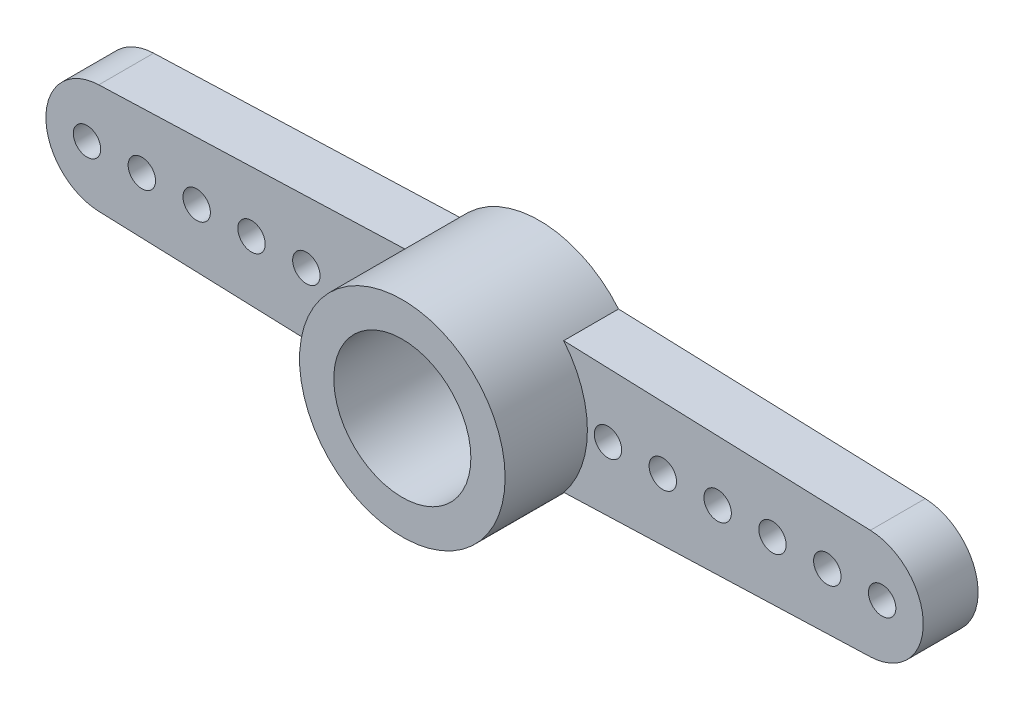
ISO-10303-21;
HEADER;
FILE_DESCRIPTION(('STEP AP214'),'2;1');
FILE_NAME('part.step','',(''),(''),'','','');
FILE_SCHEMA(('AUTOMOTIVE_DESIGN { 1 0 10303 214 1 1 1 1 }'));
ENDSEC;
DATA;
#1=APPLICATION_CONTEXT('core data for automotive mechanical design processes');
#2=APPLICATION_PROTOCOL_DEFINITION('international standard','automotive_design',2000,#1);
#3=PRODUCT_CONTEXT('',#1,'mechanical');
#4=PRODUCT('Part','Part','',(#3));
#5=PRODUCT_RELATED_PRODUCT_CATEGORY('part','',(#4));
#6=PRODUCT_DEFINITION_FORMATION('','',#4);
#7=PRODUCT_DEFINITION_CONTEXT('part definition',#1,'design');
#8=PRODUCT_DEFINITION('design','',#6,#7);
#9=PRODUCT_DEFINITION_SHAPE('','',#8);
#10=(LENGTH_UNIT() NAMED_UNIT(*) SI_UNIT(.MILLI.,.METRE.));
#11=(NAMED_UNIT(*) PLANE_ANGLE_UNIT() SI_UNIT($,.RADIAN.));
#12=(NAMED_UNIT(*) SI_UNIT($,.STERADIAN.) SOLID_ANGLE_UNIT());
#13=UNCERTAINTY_MEASURE_WITH_UNIT(LENGTH_MEASURE(1.E-05),#10,'distance_accuracy_value','');
#14=(GEOMETRIC_REPRESENTATION_CONTEXT(3) GLOBAL_UNCERTAINTY_ASSIGNED_CONTEXT((#13)) GLOBAL_UNIT_ASSIGNED_CONTEXT((#10,
#11,#12)) REPRESENTATION_CONTEXT('',''));
#15=CARTESIAN_POINT('',(0.,0.,0.));
#16=DIRECTION('',(0.,0.,1.));
#17=DIRECTION('',(1.,0.,0.));
#18=AXIS2_PLACEMENT_3D('',#15,#16,#17);
#19=CARTESIAN_POINT('',(0.,0.,0.));
#20=DIRECTION('',(0.,0.,1.));
#21=DIRECTION('',(1.,0.,0.));
#22=AXIS2_PLACEMENT_3D('',#19,#20,#21);
#23=CYLINDRICAL_SURFACE('',#22,2.5);
#24=CARTESIAN_POINT('',(0.,0.,5.));
#25=DIRECTION('',(0.,0.,1.));
#26=DIRECTION('',(1.,0.,0.));
#27=AXIS2_PLACEMENT_3D('',#24,#25,#26);
#28=CIRCLE('',#27,2.5);
#29=CARTESIAN_POINT('',(2.5,0.,5.));
#30=VERTEX_POINT('',#29);
#31=EDGE_CURVE('E543',#30,#30,#28,.T.);
#32=ORIENTED_EDGE('',*,*,#31,.T.);
#33=EDGE_LOOP('',(#32));
#34=FACE_BOUND('',#33,.T.);
#35=CARTESIAN_POINT('',(0.,0.,1.));
#36=DIRECTION('',(0.,0.,-1.));
#37=DIRECTION('',(-1.,0.,0.));
#38=AXIS2_PLACEMENT_3D('',#35,#36,#37);
#39=CIRCLE('',#38,2.5);
#40=CARTESIAN_POINT('',(-2.5,0.,1.));
#41=VERTEX_POINT('',#40);
#42=EDGE_CURVE('E469',#41,#41,#39,.T.);
#43=ORIENTED_EDGE('',*,*,#42,.T.);
#44=EDGE_LOOP('',(#43));
#45=FACE_BOUND('',#44,.T.);
#46=ADVANCED_FACE('F45',(#34,#45),#23,.F.);
#47=CARTESIAN_POINT('',(0.,0.,2.));
#48=DIRECTION('',(0.,0.,1.));
#49=DIRECTION('',(1.,0.,0.));
#50=AXIS2_PLACEMENT_3D('',#47,#48,#49);
#51=PLANE('',#50);
#52=CARTESIAN_POINT('',(-12.5,0.,2.));
#53=DIRECTION('',(0.,0.,-1.));
#54=DIRECTION('',(-1.,0.,0.));
#55=AXIS2_PLACEMENT_3D('',#52,#53,#54);
#56=CIRCLE('',#55,0.500000000000001);
#57=CARTESIAN_POINT('',(-13.,0.,2.));
#58=VERTEX_POINT('',#57);
#59=EDGE_CURVE('E483',#58,#58,#56,.F.);
#60=ORIENTED_EDGE('',*,*,#59,.F.);
#61=EDGE_LOOP('',(#60));
#62=FACE_BOUND('',#61,.T.);
#63=CARTESIAN_POINT('',(-8.5,0.,2.));
#64=DIRECTION('',(0.,0.,-1.));
#65=DIRECTION('',(-1.,0.,0.));
#66=AXIS2_PLACEMENT_3D('',#63,#64,#65);
#67=CIRCLE('',#66,0.500000000000001);
#68=CARTESIAN_POINT('',(-9.,0.,2.));
#69=VERTEX_POINT('',#68);
#70=EDGE_CURVE('E495',#69,#69,#67,.F.);
#71=ORIENTED_EDGE('',*,*,#70,.F.);
#72=EDGE_LOOP('',(#71));
#73=FACE_BOUND('',#72,.T.);
#74=CARTESIAN_POINT('',(-4.5,0.,2.));
#75=DIRECTION('',(0.,0.,-1.));
#76=DIRECTION('',(-1.,0.,0.));
#77=AXIS2_PLACEMENT_3D('',#74,#75,#76);
#78=CIRCLE('',#77,0.500000000000001);
#79=CARTESIAN_POINT('',(-5.,0.,2.));
#80=VERTEX_POINT('',#79);
#81=EDGE_CURVE('E507',#80,#80,#78,.F.);
#82=ORIENTED_EDGE('',*,*,#81,.F.);
#83=EDGE_LOOP('',(#82));
#84=FACE_BOUND('',#83,.T.);
#85=CARTESIAN_POINT('',(0.,0.,2.));
#86=DIRECTION('',(0.,0.,1.));
#87=DIRECTION('',(1.,0.,0.));
#88=AXIS2_PLACEMENT_3D('',#85,#86,#87);
#89=CIRCLE('',#88,3.75);
#90=CARTESIAN_POINT('',(-2.88547071027724,2.39511143376089,2.));
#91=VERTEX_POINT('',#90);
#92=CARTESIAN_POINT('',(-2.88547071027724,-2.39511143376089,2.));
#93=VERTEX_POINT('',#92);
#94=EDGE_CURVE('E12',#91,#93,#89,.T.);
#95=ORIENTED_EDGE('',*,*,#94,.F.);
#96=DIRECTION('',(0.999372730394994,0.0354139201848026,0.));
#97=VECTOR('',#96,1.);
#98=CARTESIAN_POINT('',(-0.0883858807695831,2.49422934631706,2.));
#99=LINE('',#98,#97);
#100=CARTESIAN_POINT('',(-14.0708278403696,1.99874546078999,2.));
#101=VERTEX_POINT('',#100);
#102=EDGE_CURVE('E190',#101,#91,#99,.T.);
#103=ORIENTED_EDGE('',*,*,#102,.F.);
#104=CARTESIAN_POINT('',(-14.,0.,2.));
#105=DIRECTION('',(0.,0.,1.));
#106=DIRECTION('',(1.,0.,0.));
#107=AXIS2_PLACEMENT_3D('',#104,#105,#106);
#108=CIRCLE('',#107,2.);
#109=CARTESIAN_POINT('',(-14.0708278403696,-1.99874546078999,2.));
#110=VERTEX_POINT('',#109);
#111=EDGE_CURVE('E183',#110,#101,#108,.F.);
#112=ORIENTED_EDGE('',*,*,#111,.F.);
#113=DIRECTION('',(0.999372730394994,-0.0354139201848024,0.));
#114=VECTOR('',#113,1.);
#115=CARTESIAN_POINT('',(-0.0883858807695825,-2.49422934631706,2.));
#116=LINE('',#115,#114);
#117=EDGE_CURVE('E187',#110,#93,#116,.T.);
#118=ORIENTED_EDGE('',*,*,#117,.T.);
#119=EDGE_LOOP('',(#95,#103,#112,#118));
#120=FACE_BOUND('',#119,.T.);
#121=CARTESIAN_POINT('',(-6.5,0.,2.));
#122=DIRECTION('',(0.,0.,-1.));
#123=DIRECTION('',(-1.,0.,0.));
#124=AXIS2_PLACEMENT_3D('',#121,#122,#123);
#125=CIRCLE('',#124,0.500000000000001);
#126=CARTESIAN_POINT('',(-7.,0.,2.));
#127=VERTEX_POINT('',#126);
#128=EDGE_CURVE('E501',#127,#127,#125,.F.);
#129=ORIENTED_EDGE('',*,*,#128,.F.);
#130=EDGE_LOOP('',(#129));
#131=FACE_BOUND('',#130,.T.);
#132=CARTESIAN_POINT('',(-10.5,0.,2.));
#133=DIRECTION('',(0.,0.,-1.));
#134=DIRECTION('',(-1.,0.,0.));
#135=AXIS2_PLACEMENT_3D('',#132,#133,#134);
#136=CIRCLE('',#135,0.500000000000001);
#137=CARTESIAN_POINT('',(-11.,0.,2.));
#138=VERTEX_POINT('',#137);
#139=EDGE_CURVE('E489',#138,#138,#136,.F.);
#140=ORIENTED_EDGE('',*,*,#139,.F.);
#141=EDGE_LOOP('',(#140));
#142=FACE_BOUND('',#141,.T.);
#143=CARTESIAN_POINT('',(-14.5,0.,2.));
#144=DIRECTION('',(0.,0.,-1.));
#145=DIRECTION('',(-1.,0.,0.));
#146=AXIS2_PLACEMENT_3D('',#143,#144,#145);
#147=CIRCLE('',#146,0.500000000000001);
#148=CARTESIAN_POINT('',(-15.,0.,2.));
#149=VERTEX_POINT('',#148);
#150=EDGE_CURVE('E477',#149,#149,#147,.F.);
#151=ORIENTED_EDGE('',*,*,#150,.F.);
#152=EDGE_LOOP('',(#151));
#153=FACE_BOUND('',#152,.T.);
#154=ADVANCED_FACE('F191',(#62,#73,#84,#120,#131,#142,#153),#51,.T.);
#155=CARTESIAN_POINT('',(0.,0.,0.));
#156=DIRECTION('',(0.,0.,1.));
#157=DIRECTION('',(1.,0.,0.));
#158=AXIS2_PLACEMENT_3D('',#155,#156,#157);
#159=PLANE('',#158);
#160=CARTESIAN_POINT('',(0.,0.,0.));
#161=DIRECTION('',(0.,0.,-1.));
#162=DIRECTION('',(-1.,0.,0.));
#163=AXIS2_PLACEMENT_3D('',#160,#161,#162);
#164=CIRCLE('',#163,2.5);
#165=CARTESIAN_POINT('',(-2.5,0.,0.));
#166=VERTEX_POINT('',#165);
#167=EDGE_CURVE('E461',#166,#166,#164,.T.);
#168=ORIENTED_EDGE('',*,*,#167,.F.);
#169=EDGE_LOOP('',(#168));
#170=FACE_BOUND('',#169,.T.);
#171=CARTESIAN_POINT('',(12.5,0.,0.));
#172=DIRECTION('',(0.,0.,-1.));
#173=DIRECTION('',(-1.,0.,0.));
#174=AXIS2_PLACEMENT_3D('',#171,#172,#173);
#175=CIRCLE('',#174,0.500000000000001);
#176=CARTESIAN_POINT('',(12.,0.,0.));
#177=VERTEX_POINT('',#176);
#178=EDGE_CURVE('E474',#177,#177,#175,.T.);
#179=ORIENTED_EDGE('',*,*,#178,.F.);
#180=EDGE_LOOP('',(#179));
#181=FACE_BOUND('',#180,.T.);
#182=CARTESIAN_POINT('',(-12.5,0.,0.));
#183=DIRECTION('',(0.,0.,-1.));
#184=DIRECTION('',(-1.,0.,0.));
#185=AXIS2_PLACEMENT_3D('',#182,#183,#184);
#186=CIRCLE('',#185,0.500000000000001);
#187=CARTESIAN_POINT('',(-13.,0.,0.));
#188=VERTEX_POINT('',#187);
#189=EDGE_CURVE('E486',#188,#188,#186,.F.);
#190=ORIENTED_EDGE('',*,*,#189,.T.);
#191=EDGE_LOOP('',(#190));
#192=FACE_BOUND('',#191,.T.);
#193=CARTESIAN_POINT('',(-8.5,0.,0.));
#194=DIRECTION('',(0.,0.,-1.));
#195=DIRECTION('',(-1.,0.,0.));
#196=AXIS2_PLACEMENT_3D('',#193,#194,#195);
#197=CIRCLE('',#196,0.500000000000001);
#198=CARTESIAN_POINT('',(-9.,0.,0.));
#199=VERTEX_POINT('',#198);
#200=EDGE_CURVE('E498',#199,#199,#197,.F.);
#201=ORIENTED_EDGE('',*,*,#200,.T.);
#202=EDGE_LOOP('',(#201));
#203=FACE_BOUND('',#202,.T.);
#204=CARTESIAN_POINT('',(-4.5,0.,0.));
#205=DIRECTION('',(0.,0.,-1.));
#206=DIRECTION('',(-1.,0.,0.));
#207=AXIS2_PLACEMENT_3D('',#204,#205,#206);
#208=CIRCLE('',#207,0.500000000000001);
#209=CARTESIAN_POINT('',(-5.,0.,0.));
#210=VERTEX_POINT('',#209);
#211=EDGE_CURVE('E510',#210,#210,#208,.F.);
#212=ORIENTED_EDGE('',*,*,#211,.T.);
#213=EDGE_LOOP('',(#212));
#214=FACE_BOUND('',#213,.T.);
#215=CARTESIAN_POINT('',(4.5,0.,0.));
#216=DIRECTION('',(0.,0.,-1.));
#217=DIRECTION('',(-1.,0.,0.));
#218=AXIS2_PLACEMENT_3D('',#215,#216,#217);
#219=CIRCLE('',#218,0.500000000000001);
#220=CARTESIAN_POINT('',(4.,0.,0.));
#221=VERTEX_POINT('',#220);
#222=EDGE_CURVE('E516',#221,#221,#219,.T.);
#223=ORIENTED_EDGE('',*,*,#222,.F.);
#224=EDGE_LOOP('',(#223));
#225=FACE_BOUND('',#224,.T.);
#226=CARTESIAN_POINT('',(6.5,0.,0.));
#227=DIRECTION('',(0.,0.,-1.));
#228=DIRECTION('',(-1.,0.,0.));
#229=AXIS2_PLACEMENT_3D('',#226,#227,#228);
#230=CIRCLE('',#229,0.500000000000001);
#231=CARTESIAN_POINT('',(6.,0.,0.));
#232=VERTEX_POINT('',#231);
#233=EDGE_CURVE('E522',#232,#232,#230,.T.);
#234=ORIENTED_EDGE('',*,*,#233,.F.);
#235=EDGE_LOOP('',(#234));
#236=FACE_BOUND('',#235,.T.);
#237=CARTESIAN_POINT('',(8.5,0.,0.));
#238=DIRECTION('',(0.,0.,-1.));
#239=DIRECTION('',(-1.,0.,0.));
#240=AXIS2_PLACEMENT_3D('',#237,#238,#239);
#241=CIRCLE('',#240,0.500000000000001);
#242=CARTESIAN_POINT('',(8.,0.,0.));
#243=VERTEX_POINT('',#242);
#244=EDGE_CURVE('E528',#243,#243,#241,.T.);
#245=ORIENTED_EDGE('',*,*,#244,.F.);
#246=EDGE_LOOP('',(#245));
#247=FACE_BOUND('',#246,.T.);
#248=CARTESIAN_POINT('',(10.5,0.,0.));
#249=DIRECTION('',(0.,0.,-1.));
#250=DIRECTION('',(-1.,0.,0.));
#251=AXIS2_PLACEMENT_3D('',#248,#249,#250);
#252=CIRCLE('',#251,0.500000000000001);
#253=CARTESIAN_POINT('',(10.,0.,0.));
#254=VERTEX_POINT('',#253);
#255=EDGE_CURVE('E534',#254,#254,#252,.T.);
#256=ORIENTED_EDGE('',*,*,#255,.F.);
#257=EDGE_LOOP('',(#256));
#258=FACE_BOUND('',#257,.T.);
#259=CARTESIAN_POINT('',(14.5,0.,0.));
#260=DIRECTION('',(0.,0.,-1.));
#261=DIRECTION('',(-1.,0.,0.));
#262=AXIS2_PLACEMENT_3D('',#259,#260,#261);
#263=CIRCLE('',#262,0.500000000000001);
#264=CARTESIAN_POINT('',(14.,0.,0.));
#265=VERTEX_POINT('',#264);
#266=EDGE_CURVE('E537',#265,#265,#263,.T.);
#267=ORIENTED_EDGE('',*,*,#266,.F.);
#268=EDGE_LOOP('',(#267));
#269=FACE_BOUND('',#268,.T.);
#270=DIRECTION('',(-0.999372730394994,-0.0354139201848029,0.));
#271=VECTOR('',#270,1.);
#272=CARTESIAN_POINT('',(0.0883858807695838,-2.49422934631706,0.));
#273=LINE('',#272,#271);
#274=CARTESIAN_POINT('',(14.0708278403696,-1.99874546078998,0.));
#275=VERTEX_POINT('',#274);
#276=CARTESIAN_POINT('',(2.88547071027724,-2.39511143376089,0.));
#277=VERTEX_POINT('',#276);
#278=EDGE_CURVE('E119',#275,#277,#273,.T.);
#279=ORIENTED_EDGE('',*,*,#278,.T.);
#280=CARTESIAN_POINT('',(0.,0.,0.));
#281=DIRECTION('',(0.,0.,-1.));
#282=DIRECTION('',(-1.,0.,0.));
#283=AXIS2_PLACEMENT_3D('',#280,#281,#282);
#284=CIRCLE('',#283,3.75);
#285=CARTESIAN_POINT('',(-2.88547071027724,-2.39511143376089,0.));
#286=VERTEX_POINT('',#285);
#287=EDGE_CURVE('E96',#277,#286,#284,.T.);
#288=ORIENTED_EDGE('',*,*,#287,.T.);
#289=DIRECTION('',(0.999372730394994,-0.0354139201848024,0.));
#290=VECTOR('',#289,1.);
#291=CARTESIAN_POINT('',(-0.0883858807695825,-2.49422934631706,0.));
#292=LINE('',#291,#290);
#293=CARTESIAN_POINT('',(-14.0708278403696,-1.99874546078999,0.));
#294=VERTEX_POINT('',#293);
#295=EDGE_CURVE('E153',#294,#286,#292,.T.);
#296=ORIENTED_EDGE('',*,*,#295,.F.);
#297=CARTESIAN_POINT('',(-14.,0.,0.));
#298=DIRECTION('',(0.,0.,1.));
#299=DIRECTION('',(1.,0.,0.));
#300=AXIS2_PLACEMENT_3D('',#297,#298,#299);
#301=CIRCLE('',#300,2.);
#302=CARTESIAN_POINT('',(-14.0708278403696,1.99874546078999,0.));
#303=VERTEX_POINT('',#302);
#304=EDGE_CURVE('E185',#294,#303,#301,.F.);
#305=ORIENTED_EDGE('',*,*,#304,.T.);
#306=DIRECTION('',(0.999372730394994,0.0354139201848026,0.));
#307=VECTOR('',#306,1.);
#308=CARTESIAN_POINT('',(-0.0883858807695831,2.49422934631706,0.));
#309=LINE('',#308,#307);
#310=CARTESIAN_POINT('',(-2.88547071027724,2.39511143376089,0.));
#311=VERTEX_POINT('',#310);
#312=EDGE_CURVE('E62',#303,#311,#309,.T.);
#313=ORIENTED_EDGE('',*,*,#312,.T.);
#314=CARTESIAN_POINT('',(2.88547071027724,2.39511143376089,0.));
#315=VERTEX_POINT('',#314);
#316=EDGE_CURVE('E86',#311,#315,#284,.T.);
#317=ORIENTED_EDGE('',*,*,#316,.T.);
#318=DIRECTION('',(-0.999372730394994,0.0354139201848023,0.));
#319=VECTOR('',#318,1.);
#320=CARTESIAN_POINT('',(0.0883858807695825,2.49422934631706,0.));
#321=LINE('',#320,#319);
#322=CARTESIAN_POINT('',(14.0708278403696,1.99874546078999,0.));
#323=VERTEX_POINT('',#322);
#324=EDGE_CURVE('E93',#323,#315,#321,.T.);
#325=ORIENTED_EDGE('',*,*,#324,.F.);
#326=CARTESIAN_POINT('',(14.,0.,0.));
#327=DIRECTION('',(0.,0.,1.));
#328=DIRECTION('',(1.,0.,0.));
#329=AXIS2_PLACEMENT_3D('',#326,#327,#328);
#330=CIRCLE('',#329,2.);
#331=EDGE_CURVE('E115',#275,#323,#330,.T.);
#332=ORIENTED_EDGE('',*,*,#331,.F.);
#333=EDGE_LOOP('',(#279,#288,#296,#305,#313,#317,#325,#332));
#334=FACE_BOUND('',#333,.T.);
#335=CARTESIAN_POINT('',(-6.5,0.,0.));
#336=DIRECTION('',(0.,0.,-1.));
#337=DIRECTION('',(-1.,0.,0.));
#338=AXIS2_PLACEMENT_3D('',#335,#336,#337);
#339=CIRCLE('',#338,0.500000000000001);
#340=CARTESIAN_POINT('',(-7.,0.,0.));
#341=VERTEX_POINT('',#340);
#342=EDGE_CURVE('E504',#341,#341,#339,.F.);
#343=ORIENTED_EDGE('',*,*,#342,.T.);
#344=EDGE_LOOP('',(#343));
#345=FACE_BOUND('',#344,.T.);
#346=CARTESIAN_POINT('',(-10.5,0.,0.));
#347=DIRECTION('',(0.,0.,-1.));
#348=DIRECTION('',(-1.,0.,0.));
#349=AXIS2_PLACEMENT_3D('',#346,#347,#348);
#350=CIRCLE('',#349,0.500000000000001);
#351=CARTESIAN_POINT('',(-11.,0.,0.));
#352=VERTEX_POINT('',#351);
#353=EDGE_CURVE('E492',#352,#352,#350,.F.);
#354=ORIENTED_EDGE('',*,*,#353,.T.);
#355=EDGE_LOOP('',(#354));
#356=FACE_BOUND('',#355,.T.);
#357=CARTESIAN_POINT('',(-14.5,0.,0.));
#358=DIRECTION('',(0.,0.,-1.));
#359=DIRECTION('',(-1.,0.,0.));
#360=AXIS2_PLACEMENT_3D('',#357,#358,#359);
#361=CIRCLE('',#360,0.500000000000001);
#362=CARTESIAN_POINT('',(-15.,0.,0.));
#363=VERTEX_POINT('',#362);
#364=EDGE_CURVE('E480',#363,#363,#361,.F.);
#365=ORIENTED_EDGE('',*,*,#364,.T.);
#366=EDGE_LOOP('',(#365));
#367=FACE_BOUND('',#366,.T.);
#368=ADVANCED_FACE('F89',(#170,#181,#192,#203,#214,#225,#236,#247,#258,#269,#334,#345,#356,
#367),#159,.F.);
#369=CARTESIAN_POINT('',(0.0883858807695838,-2.49422934631706,2.));
#370=DIRECTION('',(0.0354139201848029,-0.999372730394994,0.));
#371=DIRECTION('',(0.999372730394994,0.0354139201848029,0.));
#372=AXIS2_PLACEMENT_3D('',#369,#370,#371);
#373=PLANE('',#372);
#374=ORIENTED_EDGE('',*,*,#278,.F.);
#375=DIRECTION('',(0.,0.,-1.));
#376=VECTOR('',#375,1.);
#377=CARTESIAN_POINT('',(14.0708278403696,-1.99874546078998,2.));
#378=LINE('',#377,#376);
#379=CARTESIAN_POINT('',(14.0708278403696,-1.99874546078998,2.));
#380=VERTEX_POINT('',#379);
#381=EDGE_CURVE('E124',#380,#275,#378,.T.);
#382=ORIENTED_EDGE('',*,*,#381,.F.);
#383=DIRECTION('',(-0.999372730394994,-0.0354139201848029,0.));
#384=VECTOR('',#383,1.);
#385=CARTESIAN_POINT('',(0.0883858807695838,-2.49422934631706,2.));
#386=LINE('',#385,#384);
#387=CARTESIAN_POINT('',(2.88547071027724,-2.39511143376089,2.));
#388=VERTEX_POINT('',#387);
#389=EDGE_CURVE('E114',#380,#388,#386,.T.);
#390=ORIENTED_EDGE('',*,*,#389,.T.);
#391=DIRECTION('',(0.,0.,-1.));
#392=VECTOR('',#391,1.);
#393=CARTESIAN_POINT('',(2.88547071027724,-2.39511143376089,2.));
#394=LINE('',#393,#392);
#395=EDGE_CURVE('E110',#388,#277,#394,.T.);
#396=ORIENTED_EDGE('',*,*,#395,.T.);
#397=EDGE_LOOP('',(#374,#382,#390,#396));
#398=FACE_BOUND('',#397,.T.);
#399=ADVANCED_FACE('F47',(#398),#373,.T.);
#400=CARTESIAN_POINT('',(14.,0.,2.));
#401=DIRECTION('',(0.,0.,-1.));
#402=DIRECTION('',(-1.,0.,0.));
#403=AXIS2_PLACEMENT_3D('',#400,#401,#402);
#404=CYLINDRICAL_SURFACE('',#403,2.);
#405=ORIENTED_EDGE('',*,*,#331,.T.);
#406=DIRECTION('',(0.,0.,-1.));
#407=VECTOR('',#406,1.);
#408=CARTESIAN_POINT('',(14.0708278403696,1.99874546078999,2.));
#409=LINE('',#408,#407);
#410=CARTESIAN_POINT('',(14.0708278403696,1.99874546078999,2.));
#411=VERTEX_POINT('',#410);
#412=EDGE_CURVE('E109',#411,#323,#409,.T.);
#413=ORIENTED_EDGE('',*,*,#412,.F.);
#414=CARTESIAN_POINT('',(14.,0.,2.));
#415=DIRECTION('',(0.,0.,1.));
#416=DIRECTION('',(1.,0.,0.));
#417=AXIS2_PLACEMENT_3D('',#414,#415,#416);
#418=CIRCLE('',#417,2.);
#419=EDGE_CURVE('E71',#380,#411,#418,.T.);
#420=ORIENTED_EDGE('',*,*,#419,.F.);
#421=ORIENTED_EDGE('',*,*,#381,.T.);
#422=EDGE_LOOP('',(#405,#413,#420,#421));
#423=FACE_BOUND('',#422,.T.);
#424=ADVANCED_FACE('F246',(#423),#404,.T.);
#425=CARTESIAN_POINT('',(0.0883858807695825,2.49422934631706,2.));
#426=DIRECTION('',(-0.0354139201848023,-0.999372730394994,0.));
#427=DIRECTION('',(0.999372730394994,-0.0354139201848023,0.));
#428=AXIS2_PLACEMENT_3D('',#425,#426,#427);
#429=PLANE('',#428);
#430=ORIENTED_EDGE('',*,*,#324,.T.);
#431=DIRECTION('',(0.,0.,-1.));
#432=VECTOR('',#431,1.);
#433=CARTESIAN_POINT('',(2.88547071027724,2.39511143376089,2.));
#434=LINE('',#433,#432);
#435=CARTESIAN_POINT('',(2.88547071027724,2.39511143376089,2.));
#436=VERTEX_POINT('',#435);
#437=EDGE_CURVE('E101',#436,#315,#434,.T.);
#438=ORIENTED_EDGE('',*,*,#437,.F.);
#439=DIRECTION('',(-0.999372730394994,0.0354139201848023,0.));
#440=VECTOR('',#439,1.);
#441=CARTESIAN_POINT('',(0.0883858807695825,2.49422934631706,2.));
#442=LINE('',#441,#440);
#443=EDGE_CURVE('E138',#411,#436,#442,.T.);
#444=ORIENTED_EDGE('',*,*,#443,.F.);
#445=ORIENTED_EDGE('',*,*,#412,.T.);
#446=EDGE_LOOP('',(#430,#438,#444,#445));
#447=FACE_BOUND('',#446,.T.);
#448=ADVANCED_FACE('F113',(#447),#429,.F.);
#449=CARTESIAN_POINT('',(12.5,0.,2.));
#450=DIRECTION('',(0.,0.,-1.));
#451=DIRECTION('',(-1.,0.,0.));
#452=AXIS2_PLACEMENT_3D('',#449,#450,#451);
#453=CIRCLE('',#452,0.500000000000001);
#454=CARTESIAN_POINT('',(12.,0.,2.));
#455=VERTEX_POINT('',#454);
#456=EDGE_CURVE('E473',#455,#455,#453,.T.);
#457=ORIENTED_EDGE('',*,*,#456,.T.);
#458=EDGE_LOOP('',(#457));
#459=FACE_BOUND('',#458,.T.);
#460=CARTESIAN_POINT('',(4.5,0.,2.));
#461=DIRECTION('',(0.,0.,-1.));
#462=DIRECTION('',(-1.,0.,0.));
#463=AXIS2_PLACEMENT_3D('',#460,#461,#462);
#464=CIRCLE('',#463,0.500000000000001);
#465=CARTESIAN_POINT('',(4.,0.,2.));
#466=VERTEX_POINT('',#465);
#467=EDGE_CURVE('E513',#466,#466,#464,.T.);
#468=ORIENTED_EDGE('',*,*,#467,.T.);
#469=EDGE_LOOP('',(#468));
#470=FACE_BOUND('',#469,.T.);
#471=CARTESIAN_POINT('',(6.5,0.,2.));
#472=DIRECTION('',(0.,0.,-1.));
#473=DIRECTION('',(-1.,0.,0.));
#474=AXIS2_PLACEMENT_3D('',#471,#472,#473);
#475=CIRCLE('',#474,0.500000000000001);
#476=CARTESIAN_POINT('',(6.,0.,2.));
#477=VERTEX_POINT('',#476);
#478=EDGE_CURVE('E519',#477,#477,#475,.T.);
#479=ORIENTED_EDGE('',*,*,#478,.T.);
#480=EDGE_LOOP('',(#479));
#481=FACE_BOUND('',#480,.T.);
#482=CARTESIAN_POINT('',(8.5,0.,2.));
#483=DIRECTION('',(0.,0.,-1.));
#484=DIRECTION('',(-1.,0.,0.));
#485=AXIS2_PLACEMENT_3D('',#482,#483,#484);
#486=CIRCLE('',#485,0.500000000000001);
#487=CARTESIAN_POINT('',(8.,0.,2.));
#488=VERTEX_POINT('',#487);
#489=EDGE_CURVE('E525',#488,#488,#486,.T.);
#490=ORIENTED_EDGE('',*,*,#489,.T.);
#491=EDGE_LOOP('',(#490));
#492=FACE_BOUND('',#491,.T.);
#493=CARTESIAN_POINT('',(10.5,0.,2.));
#494=DIRECTION('',(0.,0.,-1.));
#495=DIRECTION('',(-1.,0.,0.));
#496=AXIS2_PLACEMENT_3D('',#493,#494,#495);
#497=CIRCLE('',#496,0.500000000000001);
#498=CARTESIAN_POINT('',(10.,0.,2.));
#499=VERTEX_POINT('',#498);
#500=EDGE_CURVE('E531',#499,#499,#497,.T.);
#501=ORIENTED_EDGE('',*,*,#500,.T.);
#502=EDGE_LOOP('',(#501));
#503=FACE_BOUND('',#502,.T.);
#504=CARTESIAN_POINT('',(14.5,0.,2.));
#505=DIRECTION('',(0.,0.,-1.));
#506=DIRECTION('',(-1.,0.,0.));
#507=AXIS2_PLACEMENT_3D('',#504,#505,#506);
#508=CIRCLE('',#507,0.500000000000001);
#509=CARTESIAN_POINT('',(14.,0.,2.));
#510=VERTEX_POINT('',#509);
#511=EDGE_CURVE('E540',#510,#510,#508,.T.);
#512=ORIENTED_EDGE('',*,*,#511,.T.);
#513=EDGE_LOOP('',(#512));
#514=FACE_BOUND('',#513,.T.);
#515=EDGE_CURVE('E54',#388,#436,#89,.T.);
#516=ORIENTED_EDGE('',*,*,#515,.F.);
#517=ORIENTED_EDGE('',*,*,#389,.F.);
#518=ORIENTED_EDGE('',*,*,#419,.T.);
#519=ORIENTED_EDGE('',*,*,#443,.T.);
#520=EDGE_LOOP('',(#516,#517,#518,#519));
#521=FACE_BOUND('',#520,.T.);
#522=ADVANCED_FACE('F233',(#459,#470,#481,#492,#503,#514,#521),#51,.T.);
#523=CARTESIAN_POINT('',(0.,0.,0.));
#524=DIRECTION('',(0.,0.,1.));
#525=DIRECTION('',(1.,0.,0.));
#526=AXIS2_PLACEMENT_3D('',#523,#524,#525);
#527=CYLINDRICAL_SURFACE('',#526,3.75);
#528=ORIENTED_EDGE('',*,*,#316,.F.);
#529=DIRECTION('',(0.,0.,-1.));
#530=VECTOR('',#529,1.);
#531=CARTESIAN_POINT('',(-2.88547071027724,2.39511143376089,2.));
#532=LINE('',#531,#530);
#533=EDGE_CURVE('E203',#91,#311,#532,.T.);
#534=ORIENTED_EDGE('',*,*,#533,.F.);
#535=ORIENTED_EDGE('',*,*,#94,.T.);
#536=DIRECTION('',(0.,0.,-1.));
#537=VECTOR('',#536,1.);
#538=CARTESIAN_POINT('',(-2.88547071027724,-2.39511143376089,2.));
#539=LINE('',#538,#537);
#540=EDGE_CURVE('E159',#93,#286,#539,.T.);
#541=ORIENTED_EDGE('',*,*,#540,.T.);
#542=ORIENTED_EDGE('',*,*,#287,.F.);
#543=ORIENTED_EDGE('',*,*,#395,.F.);
#544=ORIENTED_EDGE('',*,*,#515,.T.);
#545=ORIENTED_EDGE('',*,*,#437,.T.);
#546=EDGE_LOOP('',(#528,#534,#535,#541,#542,#543,#544,#545));
#547=FACE_BOUND('',#546,.T.);
#548=CARTESIAN_POINT('',(0.,0.,5.));
#549=DIRECTION('',(0.,0.,1.));
#550=DIRECTION('',(1.,0.,0.));
#551=AXIS2_PLACEMENT_3D('',#548,#549,#550);
#552=CIRCLE('',#551,3.75);
#553=CARTESIAN_POINT('',(3.75,0.,5.));
#554=VERTEX_POINT('',#553);
#555=EDGE_CURVE('E198',#554,#554,#552,.T.);
#556=ORIENTED_EDGE('',*,*,#555,.F.);
#557=EDGE_LOOP('',(#556));
#558=FACE_BOUND('',#557,.T.);
#559=ADVANCED_FACE('F102',(#547,#558),#527,.T.);
#560=CARTESIAN_POINT('',(-14.,0.,2.));
#561=DIRECTION('',(0.,0.,-1.));
#562=DIRECTION('',(-1.,0.,0.));
#563=AXIS2_PLACEMENT_3D('',#560,#561,#562);
#564=CYLINDRICAL_SURFACE('',#563,2.);
#565=ORIENTED_EDGE('',*,*,#304,.F.);
#566=DIRECTION('',(0.,0.,-1.));
#567=VECTOR('',#566,1.);
#568=CARTESIAN_POINT('',(-14.0708278403696,-1.99874546078999,2.));
#569=LINE('',#568,#567);
#570=EDGE_CURVE('E97',#110,#294,#569,.T.);
#571=ORIENTED_EDGE('',*,*,#570,.F.);
#572=ORIENTED_EDGE('',*,*,#111,.T.);
#573=DIRECTION('',(0.,0.,-1.));
#574=VECTOR('',#573,1.);
#575=CARTESIAN_POINT('',(-14.0708278403696,1.99874546078999,2.));
#576=LINE('',#575,#574);
#577=EDGE_CURVE('E202',#101,#303,#576,.T.);
#578=ORIENTED_EDGE('',*,*,#577,.T.);
#579=EDGE_LOOP('',(#565,#571,#572,#578));
#580=FACE_BOUND('',#579,.T.);
#581=ADVANCED_FACE('F181',(#580),#564,.T.);
#582=CARTESIAN_POINT('',(-0.0883858807695825,-2.49422934631706,2.));
#583=DIRECTION('',(0.0354139201848024,0.999372730394994,0.));
#584=DIRECTION('',(-0.999372730394994,0.0354139201848024,0.));
#585=AXIS2_PLACEMENT_3D('',#582,#583,#584);
#586=PLANE('',#585);
#587=ORIENTED_EDGE('',*,*,#295,.T.);
#588=ORIENTED_EDGE('',*,*,#540,.F.);
#589=ORIENTED_EDGE('',*,*,#117,.F.);
#590=ORIENTED_EDGE('',*,*,#570,.T.);
#591=EDGE_LOOP('',(#587,#588,#589,#590));
#592=FACE_BOUND('',#591,.T.);
#593=ADVANCED_FACE('F188',(#592),#586,.F.);
#594=CARTESIAN_POINT('',(-0.0883858807695831,2.49422934631706,2.));
#595=DIRECTION('',(-0.0354139201848026,0.999372730394994,0.));
#596=DIRECTION('',(-0.999372730394994,-0.0354139201848026,0.));
#597=AXIS2_PLACEMENT_3D('',#594,#595,#596);
#598=PLANE('',#597);
#599=ORIENTED_EDGE('',*,*,#312,.F.);
#600=ORIENTED_EDGE('',*,*,#577,.F.);
#601=ORIENTED_EDGE('',*,*,#102,.T.);
#602=ORIENTED_EDGE('',*,*,#533,.T.);
#603=EDGE_LOOP('',(#599,#600,#601,#602));
#604=FACE_BOUND('',#603,.T.);
#605=ADVANCED_FACE('F213',(#604),#598,.T.);
#606=CARTESIAN_POINT('',(0.,0.,5.));
#607=DIRECTION('',(0.,0.,1.));
#608=DIRECTION('',(1.,0.,0.));
#609=AXIS2_PLACEMENT_3D('',#606,#607,#608);
#610=PLANE('',#609);
#611=ORIENTED_EDGE('',*,*,#555,.T.);
#612=EDGE_LOOP('',(#611));
#613=FACE_BOUND('',#612,.T.);
#614=ORIENTED_EDGE('',*,*,#31,.F.);
#615=EDGE_LOOP('',(#614));
#616=FACE_BOUND('',#615,.T.);
#617=ADVANCED_FACE('F215',(#613,#616),#610,.T.);
#618=CARTESIAN_POINT('',(14.5,0.,2.));
#619=DIRECTION('',(0.,0.,-1.));
#620=DIRECTION('',(-1.,0.,0.));
#621=AXIS2_PLACEMENT_3D('',#618,#619,#620);
#622=CYLINDRICAL_SURFACE('',#621,0.500000000000001);
#623=ORIENTED_EDGE('',*,*,#511,.F.);
#624=EDGE_LOOP('',(#623));
#625=FACE_BOUND('',#624,.T.);
#626=ORIENTED_EDGE('',*,*,#266,.T.);
#627=EDGE_LOOP('',(#626));
#628=FACE_BOUND('',#627,.T.);
#629=ADVANCED_FACE('F221',(#625,#628),#622,.F.);
#630=CARTESIAN_POINT('',(10.5,0.,2.));
#631=DIRECTION('',(0.,0.,-1.));
#632=DIRECTION('',(-1.,0.,0.));
#633=AXIS2_PLACEMENT_3D('',#630,#631,#632);
#634=CYLINDRICAL_SURFACE('',#633,0.500000000000001);
#635=ORIENTED_EDGE('',*,*,#500,.F.);
#636=EDGE_LOOP('',(#635));
#637=FACE_BOUND('',#636,.T.);
#638=ORIENTED_EDGE('',*,*,#255,.T.);
#639=EDGE_LOOP('',(#638));
#640=FACE_BOUND('',#639,.T.);
#641=ADVANCED_FACE('F286',(#637,#640),#634,.F.);
#642=CARTESIAN_POINT('',(8.5,0.,2.));
#643=DIRECTION('',(0.,0.,-1.));
#644=DIRECTION('',(-1.,0.,0.));
#645=AXIS2_PLACEMENT_3D('',#642,#643,#644);
#646=CYLINDRICAL_SURFACE('',#645,0.500000000000001);
#647=ORIENTED_EDGE('',*,*,#489,.F.);
#648=EDGE_LOOP('',(#647));
#649=FACE_BOUND('',#648,.T.);
#650=ORIENTED_EDGE('',*,*,#244,.T.);
#651=EDGE_LOOP('',(#650));
#652=FACE_BOUND('',#651,.T.);
#653=ADVANCED_FACE('F296',(#649,#652),#646,.F.);
#654=CARTESIAN_POINT('',(6.5,0.,2.));
#655=DIRECTION('',(0.,0.,-1.));
#656=DIRECTION('',(-1.,0.,0.));
#657=AXIS2_PLACEMENT_3D('',#654,#655,#656);
#658=CYLINDRICAL_SURFACE('',#657,0.500000000000001);
#659=ORIENTED_EDGE('',*,*,#478,.F.);
#660=EDGE_LOOP('',(#659));
#661=FACE_BOUND('',#660,.T.);
#662=ORIENTED_EDGE('',*,*,#233,.T.);
#663=EDGE_LOOP('',(#662));
#664=FACE_BOUND('',#663,.T.);
#665=ADVANCED_FACE('F306',(#661,#664),#658,.F.);
#666=CARTESIAN_POINT('',(4.5,0.,2.));
#667=DIRECTION('',(0.,0.,-1.));
#668=DIRECTION('',(-1.,0.,0.));
#669=AXIS2_PLACEMENT_3D('',#666,#667,#668);
#670=CYLINDRICAL_SURFACE('',#669,0.500000000000001);
#671=ORIENTED_EDGE('',*,*,#467,.F.);
#672=EDGE_LOOP('',(#671));
#673=FACE_BOUND('',#672,.T.);
#674=ORIENTED_EDGE('',*,*,#222,.T.);
#675=EDGE_LOOP('',(#674));
#676=FACE_BOUND('',#675,.T.);
#677=ADVANCED_FACE('F316',(#673,#676),#670,.F.);
#678=CARTESIAN_POINT('',(-4.5,0.,2.));
#679=DIRECTION('',(0.,0.,-1.));
#680=DIRECTION('',(-1.,0.,0.));
#681=AXIS2_PLACEMENT_3D('',#678,#679,#680);
#682=CYLINDRICAL_SURFACE('',#681,0.500000000000001);
#683=ORIENTED_EDGE('',*,*,#81,.T.);
#684=EDGE_LOOP('',(#683));
#685=FACE_BOUND('',#684,.T.);
#686=ORIENTED_EDGE('',*,*,#211,.F.);
#687=EDGE_LOOP('',(#686));
#688=FACE_BOUND('',#687,.T.);
#689=ADVANCED_FACE('F326',(#685,#688),#682,.F.);
#690=CARTESIAN_POINT('',(-6.5,0.,2.));
#691=DIRECTION('',(0.,0.,-1.));
#692=DIRECTION('',(-1.,0.,0.));
#693=AXIS2_PLACEMENT_3D('',#690,#691,#692);
#694=CYLINDRICAL_SURFACE('',#693,0.500000000000001);
#695=ORIENTED_EDGE('',*,*,#128,.T.);
#696=EDGE_LOOP('',(#695));
#697=FACE_BOUND('',#696,.T.);
#698=ORIENTED_EDGE('',*,*,#342,.F.);
#699=EDGE_LOOP('',(#698));
#700=FACE_BOUND('',#699,.T.);
#701=ADVANCED_FACE('F336',(#697,#700),#694,.F.);
#702=CARTESIAN_POINT('',(-8.5,0.,2.));
#703=DIRECTION('',(0.,0.,-1.));
#704=DIRECTION('',(-1.,0.,0.));
#705=AXIS2_PLACEMENT_3D('',#702,#703,#704);
#706=CYLINDRICAL_SURFACE('',#705,0.500000000000001);
#707=ORIENTED_EDGE('',*,*,#70,.T.);
#708=EDGE_LOOP('',(#707));
#709=FACE_BOUND('',#708,.T.);
#710=ORIENTED_EDGE('',*,*,#200,.F.);
#711=EDGE_LOOP('',(#710));
#712=FACE_BOUND('',#711,.T.);
#713=ADVANCED_FACE('F346',(#709,#712),#706,.F.);
#714=CARTESIAN_POINT('',(-10.5,0.,2.));
#715=DIRECTION('',(0.,0.,-1.));
#716=DIRECTION('',(-1.,0.,0.));
#717=AXIS2_PLACEMENT_3D('',#714,#715,#716);
#718=CYLINDRICAL_SURFACE('',#717,0.500000000000001);
#719=ORIENTED_EDGE('',*,*,#139,.T.);
#720=EDGE_LOOP('',(#719));
#721=FACE_BOUND('',#720,.T.);
#722=ORIENTED_EDGE('',*,*,#353,.F.);
#723=EDGE_LOOP('',(#722));
#724=FACE_BOUND('',#723,.T.);
#725=ADVANCED_FACE('F356',(#721,#724),#718,.F.);
#726=CARTESIAN_POINT('',(-12.5,0.,2.));
#727=DIRECTION('',(0.,0.,-1.));
#728=DIRECTION('',(-1.,0.,0.));
#729=AXIS2_PLACEMENT_3D('',#726,#727,#728);
#730=CYLINDRICAL_SURFACE('',#729,0.500000000000001);
#731=ORIENTED_EDGE('',*,*,#59,.T.);
#732=EDGE_LOOP('',(#731));
#733=FACE_BOUND('',#732,.T.);
#734=ORIENTED_EDGE('',*,*,#189,.F.);
#735=EDGE_LOOP('',(#734));
#736=FACE_BOUND('',#735,.T.);
#737=ADVANCED_FACE('F366',(#733,#736),#730,.F.);
#738=CARTESIAN_POINT('',(-14.5,0.,2.));
#739=DIRECTION('',(0.,0.,-1.));
#740=DIRECTION('',(-1.,0.,0.));
#741=AXIS2_PLACEMENT_3D('',#738,#739,#740);
#742=CYLINDRICAL_SURFACE('',#741,0.500000000000001);
#743=ORIENTED_EDGE('',*,*,#150,.T.);
#744=EDGE_LOOP('',(#743));
#745=FACE_BOUND('',#744,.T.);
#746=ORIENTED_EDGE('',*,*,#364,.F.);
#747=EDGE_LOOP('',(#746));
#748=FACE_BOUND('',#747,.T.);
#749=ADVANCED_FACE('F376',(#745,#748),#742,.F.);
#750=CARTESIAN_POINT('',(12.5,0.,2.));
#751=DIRECTION('',(0.,0.,-1.));
#752=DIRECTION('',(-1.,0.,0.));
#753=AXIS2_PLACEMENT_3D('',#750,#751,#752);
#754=CYLINDRICAL_SURFACE('',#753,0.500000000000001);
#755=ORIENTED_EDGE('',*,*,#456,.F.);
#756=EDGE_LOOP('',(#755));
#757=FACE_BOUND('',#756,.T.);
#758=ORIENTED_EDGE('',*,*,#178,.T.);
#759=EDGE_LOOP('',(#758));
#760=FACE_BOUND('',#759,.T.);
#761=ADVANCED_FACE('F387',(#757,#760),#754,.F.);
#762=CARTESIAN_POINT('',(0.,0.,1.));
#763=DIRECTION('',(0.,0.,-1.));
#764=DIRECTION('',(-1.,0.,0.));
#765=AXIS2_PLACEMENT_3D('',#762,#763,#764);
#766=PLANE('',#765);
#767=CARTESIAN_POINT('',(0.,0.,1.));
#768=DIRECTION('',(0.,0.,-1.));
#769=DIRECTION('',(-1.,0.,0.));
#770=AXIS2_PLACEMENT_3D('',#767,#768,#769);
#771=CIRCLE('',#770,1.25);
#772=CARTESIAN_POINT('',(-1.25,0.,1.));
#773=VERTEX_POINT('',#772);
#774=EDGE_CURVE('E460',#773,#773,#771,.T.);
#775=ORIENTED_EDGE('',*,*,#774,.T.);
#776=EDGE_LOOP('',(#775));
#777=FACE_BOUND('',#776,.T.);
#778=ORIENTED_EDGE('',*,*,#42,.F.);
#779=EDGE_LOOP('',(#778));
#780=FACE_BOUND('',#779,.T.);
#781=ADVANCED_FACE('F396',(#777,#780),#766,.F.);
#782=CARTESIAN_POINT('',(0.,0.,0.5));
#783=DIRECTION('',(0.,0.,-1.));
#784=DIRECTION('',(-1.,0.,0.));
#785=AXIS2_PLACEMENT_3D('',#782,#783,#784);
#786=CYLINDRICAL_SURFACE('',#785,2.5);
#787=CARTESIAN_POINT('',(0.,0.,0.5));
#788=DIRECTION('',(0.,0.,-1.));
#789=DIRECTION('',(-1.,0.,0.));
#790=AXIS2_PLACEMENT_3D('',#787,#788,#789);
#791=CIRCLE('',#790,2.5);
#792=CARTESIAN_POINT('',(-2.5,0.,0.5));
#793=VERTEX_POINT('',#792);
#794=EDGE_CURVE('E464',#793,#793,#791,.T.);
#795=ORIENTED_EDGE('',*,*,#794,.F.);
#796=EDGE_LOOP('',(#795));
#797=FACE_BOUND('',#796,.T.);
#798=ORIENTED_EDGE('',*,*,#167,.T.);
#799=EDGE_LOOP('',(#798));
#800=FACE_BOUND('',#799,.T.);
#801=ADVANCED_FACE('F422',(#797,#800),#786,.F.);
#802=CARTESIAN_POINT('',(0.,0.,0.5));
#803=DIRECTION('',(0.,0.,-1.));
#804=DIRECTION('',(-1.,0.,0.));
#805=AXIS2_PLACEMENT_3D('',#802,#803,#804);
#806=PLANE('',#805);
#807=CARTESIAN_POINT('',(0.,0.,0.5));
#808=DIRECTION('',(0.,0.,-1.));
#809=DIRECTION('',(-1.,0.,0.));
#810=AXIS2_PLACEMENT_3D('',#807,#808,#809);
#811=CIRCLE('',#810,1.25);
#812=CARTESIAN_POINT('',(-1.25,0.,0.5));
#813=VERTEX_POINT('',#812);
#814=EDGE_CURVE('E457',#813,#813,#811,.T.);
#815=ORIENTED_EDGE('',*,*,#814,.F.);
#816=EDGE_LOOP('',(#815));
#817=FACE_BOUND('',#816,.T.);
#818=ORIENTED_EDGE('',*,*,#794,.T.);
#819=EDGE_LOOP('',(#818));
#820=FACE_BOUND('',#819,.T.);
#821=ADVANCED_FACE('F431',(#817,#820),#806,.T.);
#822=CARTESIAN_POINT('',(0.,0.,5.5));
#823=DIRECTION('',(0.,0.,-1.));
#824=DIRECTION('',(-1.,0.,0.));
#825=AXIS2_PLACEMENT_3D('',#822,#823,#824);
#826=CYLINDRICAL_SURFACE('',#825,1.25);
#827=ORIENTED_EDGE('',*,*,#814,.T.);
#828=EDGE_LOOP('',(#827));
#829=FACE_BOUND('',#828,.T.);
#830=ORIENTED_EDGE('',*,*,#774,.F.);
#831=EDGE_LOOP('',(#830));
#832=FACE_BOUND('',#831,.T.);
#833=ADVANCED_FACE('F439',(#829,#832),#826,.F.);
#834=CLOSED_SHELL('',(#46,#154,#368,#399,#424,#448,#522,#559,#581,#593,#605,#617,#629,#641,#653,
#665,#677,#689,#701,#713,#725,#737,#749,#761,#781,#801,#821,#833));
#835=MANIFOLD_SOLID_BREP('B2',#834);
#836=ADVANCED_BREP_SHAPE_REPRESENTATION('',(#18,#835),#14);
#837=SHAPE_DEFINITION_REPRESENTATION(#9,#836);
ENDSEC;
END-ISO-10303-21;
